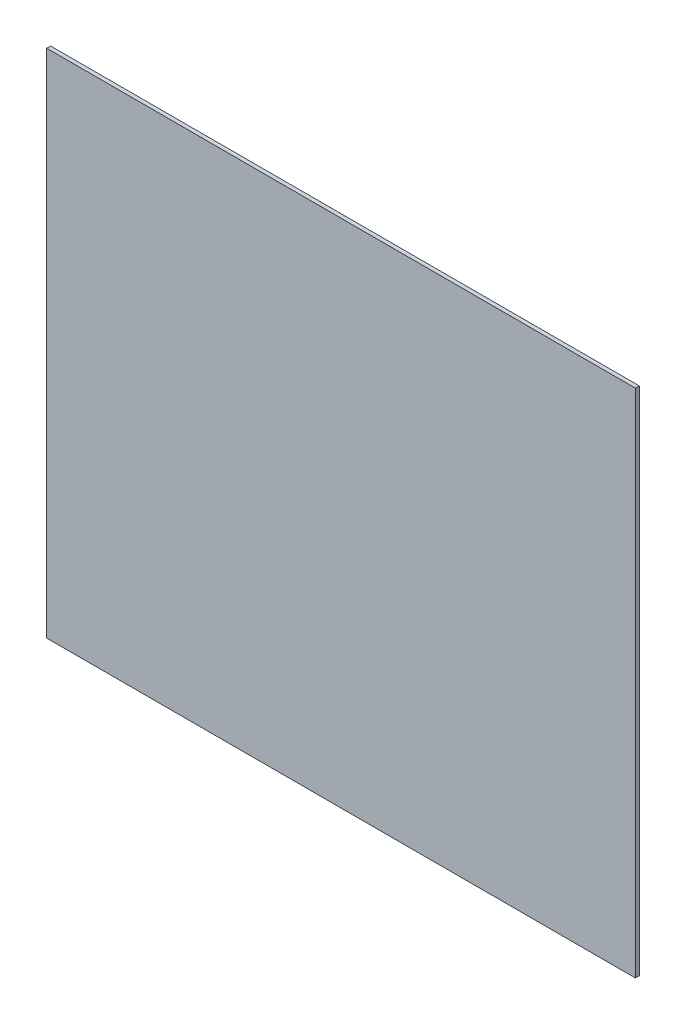
ISO-10303-21;
HEADER;
FILE_DESCRIPTION(('STEP AP214'),'2;1');
FILE_NAME('part.step','',(''),(''),'','','');
FILE_SCHEMA(('AUTOMOTIVE_DESIGN { 1 0 10303 214 1 1 1 1 }'));
ENDSEC;
DATA;
#1=APPLICATION_CONTEXT('core data for automotive mechanical design processes');
#2=APPLICATION_PROTOCOL_DEFINITION('international standard','automotive_design',2000,#1);
#3=PRODUCT_CONTEXT('',#1,'mechanical');
#4=PRODUCT('Part','Part','',(#3));
#5=PRODUCT_RELATED_PRODUCT_CATEGORY('part','',(#4));
#6=PRODUCT_DEFINITION_FORMATION('','',#4);
#7=PRODUCT_DEFINITION_CONTEXT('part definition',#1,'design');
#8=PRODUCT_DEFINITION('design','',#6,#7);
#9=PRODUCT_DEFINITION_SHAPE('','',#8);
#10=(LENGTH_UNIT() NAMED_UNIT(*) SI_UNIT(.MILLI.,.METRE.));
#11=(NAMED_UNIT(*) PLANE_ANGLE_UNIT() SI_UNIT($,.RADIAN.));
#12=(NAMED_UNIT(*) SI_UNIT($,.STERADIAN.) SOLID_ANGLE_UNIT());
#13=UNCERTAINTY_MEASURE_WITH_UNIT(LENGTH_MEASURE(1.E-05),#10,'distance_accuracy_value','');
#14=(GEOMETRIC_REPRESENTATION_CONTEXT(3) GLOBAL_UNCERTAINTY_ASSIGNED_CONTEXT((#13)) GLOBAL_UNIT_ASSIGNED_CONTEXT((#10,
#11,#12)) REPRESENTATION_CONTEXT('',''));
#15=CARTESIAN_POINT('',(0.,0.,0.));
#16=DIRECTION('',(0.,0.,1.));
#17=DIRECTION('',(1.,0.,0.));
#18=AXIS2_PLACEMENT_3D('',#15,#16,#17);
#19=CARTESIAN_POINT('',(227.,197.,0.));
#20=DIRECTION('',(0.,0.,1.));
#21=DIRECTION('',(1.,0.,0.));
#22=AXIS2_PLACEMENT_3D('',#19,#20,#21);
#23=PLANE('',#22);
#24=DIRECTION('',(0.,1.,0.));
#25=VECTOR('',#24,1.);
#26=CARTESIAN_POINT('',(0.,394.,0.));
#27=LINE('',#26,#25);
#28=CARTESIAN_POINT('',(0.,394.,0.));
#29=VERTEX_POINT('',#28);
#30=CARTESIAN_POINT('',(0.,0.,0.));
#31=VERTEX_POINT('',#30);
#32=EDGE_CURVE('E78',#29,#31,#27,.F.);
#33=ORIENTED_EDGE('',*,*,#32,.F.);
#34=DIRECTION('',(1.,0.,0.));
#35=VECTOR('',#34,1.);
#36=CARTESIAN_POINT('',(454.,394.,0.));
#37=LINE('',#36,#35);
#38=CARTESIAN_POINT('',(454.,394.,0.));
#39=VERTEX_POINT('',#38);
#40=EDGE_CURVE('E54',#39,#29,#37,.F.);
#41=ORIENTED_EDGE('',*,*,#40,.F.);
#42=DIRECTION('',(0.,1.,0.));
#43=VECTOR('',#42,1.);
#44=CARTESIAN_POINT('',(454.,0.,0.));
#45=LINE('',#44,#43);
#46=CARTESIAN_POINT('',(454.,0.,0.));
#47=VERTEX_POINT('',#46);
#48=EDGE_CURVE('E56',#47,#39,#45,.T.);
#49=ORIENTED_EDGE('',*,*,#48,.F.);
#50=DIRECTION('',(1.,0.,0.));
#51=VECTOR('',#50,1.);
#52=CARTESIAN_POINT('',(0.,0.,0.));
#53=LINE('',#52,#51);
#54=EDGE_CURVE('E19',#31,#47,#53,.T.);
#55=ORIENTED_EDGE('',*,*,#54,.F.);
#56=EDGE_LOOP('',(#33,#41,#49,#55));
#57=FACE_BOUND('',#56,.T.);
#58=ADVANCED_FACE('F16',(#57),#23,.F.);
#59=CARTESIAN_POINT('',(0.,0.,0.));
#60=DIRECTION('',(0.,-1.,0.));
#61=DIRECTION('',(0.,0.,-1.));
#62=AXIS2_PLACEMENT_3D('',#59,#60,#61);
#63=PLANE('',#62);
#64=DIRECTION('',(1.,0.,0.));
#65=VECTOR('',#64,1.);
#66=CARTESIAN_POINT('',(227.,0.,3.));
#67=LINE('',#66,#65);
#68=CARTESIAN_POINT('',(0.,0.,3.));
#69=VERTEX_POINT('',#68);
#70=CARTESIAN_POINT('',(454.,0.,3.));
#71=VERTEX_POINT('',#70);
#72=EDGE_CURVE('E82',#69,#71,#67,.T.);
#73=ORIENTED_EDGE('',*,*,#72,.F.);
#74=DIRECTION('',(0.,0.,1.));
#75=VECTOR('',#74,1.);
#76=CARTESIAN_POINT('',(0.,0.,0.));
#77=LINE('',#76,#75);
#78=EDGE_CURVE('E67',#31,#69,#77,.T.);
#79=ORIENTED_EDGE('',*,*,#78,.F.);
#80=ORIENTED_EDGE('',*,*,#54,.T.);
#81=DIRECTION('',(0.,0.,-1.));
#82=VECTOR('',#81,1.);
#83=CARTESIAN_POINT('',(454.,0.,0.));
#84=LINE('',#83,#82);
#85=EDGE_CURVE('E62',#71,#47,#84,.T.);
#86=ORIENTED_EDGE('',*,*,#85,.F.);
#87=EDGE_LOOP('',(#73,#79,#80,#86));
#88=FACE_BOUND('',#87,.T.);
#89=ADVANCED_FACE('F64',(#88),#63,.T.);
#90=CARTESIAN_POINT('',(454.,0.,0.));
#91=DIRECTION('',(1.,0.,0.));
#92=DIRECTION('',(0.,0.,-1.));
#93=AXIS2_PLACEMENT_3D('',#90,#91,#92);
#94=PLANE('',#93);
#95=DIRECTION('',(0.,1.,0.));
#96=VECTOR('',#95,1.);
#97=CARTESIAN_POINT('',(454.,197.,3.));
#98=LINE('',#97,#96);
#99=CARTESIAN_POINT('',(454.,394.,3.));
#100=VERTEX_POINT('',#99);
#101=EDGE_CURVE('E71',#71,#100,#98,.T.);
#102=ORIENTED_EDGE('',*,*,#101,.F.);
#103=ORIENTED_EDGE('',*,*,#85,.T.);
#104=ORIENTED_EDGE('',*,*,#48,.T.);
#105=DIRECTION('',(0.,0.,1.));
#106=VECTOR('',#105,1.);
#107=CARTESIAN_POINT('',(454.,394.,0.));
#108=LINE('',#107,#106);
#109=EDGE_CURVE('E74',#100,#39,#108,.F.);
#110=ORIENTED_EDGE('',*,*,#109,.F.);
#111=EDGE_LOOP('',(#102,#103,#104,#110));
#112=FACE_BOUND('',#111,.T.);
#113=ADVANCED_FACE('F69',(#112),#94,.T.);
#114=CARTESIAN_POINT('',(454.,394.,0.));
#115=DIRECTION('',(0.,1.,0.));
#116=DIRECTION('',(0.,0.,1.));
#117=AXIS2_PLACEMENT_3D('',#114,#115,#116);
#118=PLANE('',#117);
#119=DIRECTION('',(1.,0.,0.));
#120=VECTOR('',#119,1.);
#121=CARTESIAN_POINT('',(227.,394.,3.));
#122=LINE('',#121,#120);
#123=CARTESIAN_POINT('',(0.,394.,3.));
#124=VERTEX_POINT('',#123);
#125=EDGE_CURVE('E25',#100,#124,#122,.F.);
#126=ORIENTED_EDGE('',*,*,#125,.F.);
#127=ORIENTED_EDGE('',*,*,#109,.T.);
#128=ORIENTED_EDGE('',*,*,#40,.T.);
#129=DIRECTION('',(0.,0.,1.));
#130=VECTOR('',#129,1.);
#131=CARTESIAN_POINT('',(0.,394.,0.));
#132=LINE('',#131,#130);
#133=EDGE_CURVE('E34',#124,#29,#132,.F.);
#134=ORIENTED_EDGE('',*,*,#133,.F.);
#135=EDGE_LOOP('',(#126,#127,#128,#134));
#136=FACE_BOUND('',#135,.T.);
#137=ADVANCED_FACE('F88',(#136),#118,.T.);
#138=CARTESIAN_POINT('',(0.,394.,0.));
#139=DIRECTION('',(-1.,0.,0.));
#140=DIRECTION('',(0.,0.,1.));
#141=AXIS2_PLACEMENT_3D('',#138,#139,#140);
#142=PLANE('',#141);
#143=DIRECTION('',(0.,1.,0.));
#144=VECTOR('',#143,1.);
#145=CARTESIAN_POINT('',(0.,197.,3.));
#146=LINE('',#145,#144);
#147=EDGE_CURVE('E11',#124,#69,#146,.F.);
#148=ORIENTED_EDGE('',*,*,#147,.F.);
#149=ORIENTED_EDGE('',*,*,#133,.T.);
#150=ORIENTED_EDGE('',*,*,#32,.T.);
#151=ORIENTED_EDGE('',*,*,#78,.T.);
#152=EDGE_LOOP('',(#148,#149,#150,#151));
#153=FACE_BOUND('',#152,.T.);
#154=ADVANCED_FACE('F90',(#153),#142,.T.);
#155=CARTESIAN_POINT('',(227.,197.,3.));
#156=DIRECTION('',(0.,0.,1.));
#157=DIRECTION('',(1.,0.,0.));
#158=AXIS2_PLACEMENT_3D('',#155,#156,#157);
#159=PLANE('',#158);
#160=ORIENTED_EDGE('',*,*,#125,.T.);
#161=ORIENTED_EDGE('',*,*,#147,.T.);
#162=ORIENTED_EDGE('',*,*,#72,.T.);
#163=ORIENTED_EDGE('',*,*,#101,.T.);
#164=EDGE_LOOP('',(#160,#161,#162,#163));
#165=FACE_BOUND('',#164,.T.);
#166=ADVANCED_FACE('F87',(#165),#159,.T.);
#167=CLOSED_SHELL('',(#58,#89,#113,#137,#154,#166));
#168=MANIFOLD_SOLID_BREP('B1',#167);
#169=ADVANCED_BREP_SHAPE_REPRESENTATION('',(#18,#168),#14);
#170=SHAPE_DEFINITION_REPRESENTATION(#9,#169);
ENDSEC;
END-ISO-10303-21;
